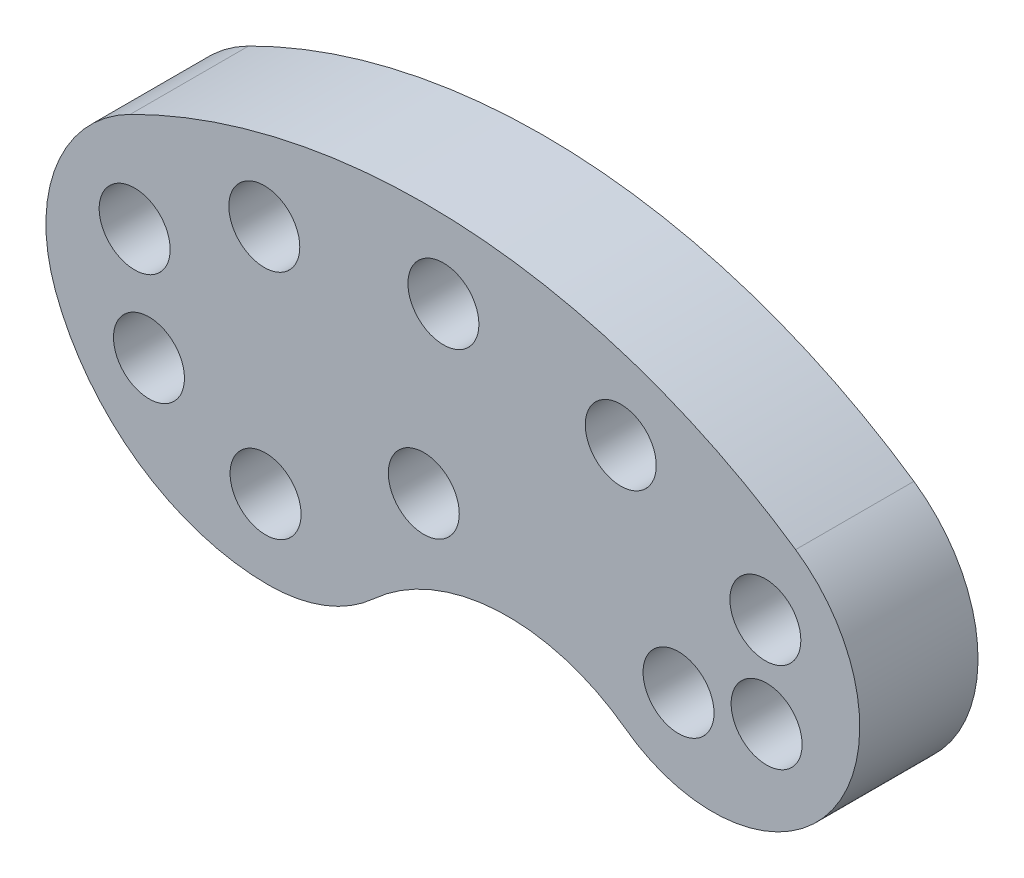
ISO-10303-21;
HEADER;
FILE_DESCRIPTION(('STEP AP214'),'2;1');
FILE_NAME('part.step','',(''),(''),'','','');
FILE_SCHEMA(('AUTOMOTIVE_DESIGN { 1 0 10303 214 1 1 1 1 }'));
ENDSEC;
DATA;
#1=APPLICATION_CONTEXT('core data for automotive mechanical design processes');
#2=APPLICATION_PROTOCOL_DEFINITION('international standard','automotive_design',2000,#1);
#3=PRODUCT_CONTEXT('',#1,'mechanical');
#4=PRODUCT('Part','Part','',(#3));
#5=PRODUCT_RELATED_PRODUCT_CATEGORY('part','',(#4));
#6=PRODUCT_DEFINITION_FORMATION('','',#4);
#7=PRODUCT_DEFINITION_CONTEXT('part definition',#1,'design');
#8=PRODUCT_DEFINITION('design','',#6,#7);
#9=PRODUCT_DEFINITION_SHAPE('','',#8);
#10=(LENGTH_UNIT() NAMED_UNIT(*) SI_UNIT(.MILLI.,.METRE.));
#11=(NAMED_UNIT(*) PLANE_ANGLE_UNIT() SI_UNIT($,.RADIAN.));
#12=(NAMED_UNIT(*) SI_UNIT($,.STERADIAN.) SOLID_ANGLE_UNIT());
#13=UNCERTAINTY_MEASURE_WITH_UNIT(LENGTH_MEASURE(1.E-05),#10,'distance_accuracy_value','');
#14=(GEOMETRIC_REPRESENTATION_CONTEXT(3) GLOBAL_UNCERTAINTY_ASSIGNED_CONTEXT((#13)) GLOBAL_UNIT_ASSIGNED_CONTEXT((#10,
#11,#12)) REPRESENTATION_CONTEXT('',''));
#15=CARTESIAN_POINT('',(0.,0.,0.));
#16=DIRECTION('',(0.,0.,1.));
#17=DIRECTION('',(1.,0.,0.));
#18=AXIS2_PLACEMENT_3D('',#15,#16,#17);
#19=CARTESIAN_POINT('',(5.85175887708347,2.1656115529364,10.));
#20=DIRECTION('',(0.,0.,-1.));
#21=DIRECTION('',(-1.,0.,0.));
#22=AXIS2_PLACEMENT_3D('',#19,#20,#21);
#23=CYLINDRICAL_SURFACE('',#22,19.2063081866916);
#24=CARTESIAN_POINT('',(5.85175887708347,2.1656115529364,0.));
#25=DIRECTION('',(0.,0.,1.));
#26=DIRECTION('',(1.,0.,0.));
#27=AXIS2_PLACEMENT_3D('',#24,#25,#26);
#28=CIRCLE('',#27,19.2063081866916);
#29=CARTESIAN_POINT('',(-12.1606430863832,-4.50039547291348,0.));
#30=VERTEX_POINT('',#29);
#31=CARTESIAN_POINT('',(5.85175887708346,-17.0406966337552,0.));
#32=VERTEX_POINT('',#31);
#33=EDGE_CURVE('E150',#30,#32,#28,.T.);
#34=ORIENTED_EDGE('',*,*,#33,.T.);
#35=DIRECTION('',(0.,0.,-1.));
#36=VECTOR('',#35,1.);
#37=CARTESIAN_POINT('',(5.85175887708346,-17.0406966337552,10.));
#38=LINE('',#37,#36);
#39=CARTESIAN_POINT('',(5.85175887708346,-17.0406966337552,10.));
#40=VERTEX_POINT('',#39);
#41=EDGE_CURVE('E13',#40,#32,#38,.T.);
#42=ORIENTED_EDGE('',*,*,#41,.F.);
#43=CARTESIAN_POINT('',(5.85175887708347,2.1656115529364,10.));
#44=DIRECTION('',(0.,0.,1.));
#45=DIRECTION('',(1.,0.,0.));
#46=AXIS2_PLACEMENT_3D('',#43,#44,#45);
#47=CIRCLE('',#46,19.2063081866916);
#48=CARTESIAN_POINT('',(-12.1606430863832,-4.50039547291348,10.));
#49=VERTEX_POINT('',#48);
#50=EDGE_CURVE('E161',#49,#40,#47,.T.);
#51=ORIENTED_EDGE('',*,*,#50,.F.);
#52=DIRECTION('',(0.,0.,-1.));
#53=VECTOR('',#52,1.);
#54=CARTESIAN_POINT('',(-12.1606430863832,-4.50039547291348,10.));
#55=LINE('',#54,#53);
#56=EDGE_CURVE('E146',#49,#30,#55,.T.);
#57=ORIENTED_EDGE('',*,*,#56,.T.);
#58=EDGE_LOOP('',(#34,#42,#51,#57));
#59=FACE_BOUND('',#58,.T.);
#60=ADVANCED_FACE('F66',(#59),#23,.T.);
#61=CARTESIAN_POINT('',(5.85175887708346,-3.8304950290572,10.));
#62=DIRECTION('',(0.,0.,-1.));
#63=DIRECTION('',(-1.,0.,0.));
#64=AXIS2_PLACEMENT_3D('',#61,#62,#63);
#65=CYLINDRICAL_SURFACE('',#64,13.210201604698);
#66=CARTESIAN_POINT('',(5.85175887708346,-3.8304950290572,0.));
#67=DIRECTION('',(0.,0.,1.));
#68=DIRECTION('',(1.,0.,0.));
#69=AXIS2_PLACEMENT_3D('',#66,#67,#68);
#70=CIRCLE('',#69,13.210201604698);
#71=CARTESIAN_POINT('',(14.7471140271899,-13.5968701595875,0.));
#72=VERTEX_POINT('',#71);
#73=EDGE_CURVE('E153',#32,#72,#70,.T.);
#74=ORIENTED_EDGE('',*,*,#73,.T.);
#75=DIRECTION('',(0.,0.,-1.));
#76=VECTOR('',#75,1.);
#77=CARTESIAN_POINT('',(14.7471140271899,-13.5968701595875,10.));
#78=LINE('',#77,#76);
#79=CARTESIAN_POINT('',(14.7471140271899,-13.5968701595875,10.));
#80=VERTEX_POINT('',#79);
#81=EDGE_CURVE('E74',#80,#72,#78,.T.);
#82=ORIENTED_EDGE('',*,*,#81,.F.);
#83=CARTESIAN_POINT('',(5.85175887708346,-3.8304950290572,10.));
#84=DIRECTION('',(0.,0.,1.));
#85=DIRECTION('',(1.,0.,0.));
#86=AXIS2_PLACEMENT_3D('',#83,#84,#85);
#87=CIRCLE('',#86,13.210201604698);
#88=EDGE_CURVE('E119',#40,#80,#87,.T.);
#89=ORIENTED_EDGE('',*,*,#88,.F.);
#90=ORIENTED_EDGE('',*,*,#41,.T.);
#91=EDGE_LOOP('',(#74,#82,#89,#90));
#92=FACE_BOUND('',#91,.T.);
#93=ADVANCED_FACE('F186',(#92),#65,.T.);
#94=CARTESIAN_POINT('',(26.0784990654728,-26.0378076111996,10.));
#95=DIRECTION('',(0.,0.,-1.));
#96=DIRECTION('',(-1.,0.,0.));
#97=AXIS2_PLACEMENT_3D('',#94,#95,#96);
#98=CYLINDRICAL_SURFACE('',#97,16.8278700839039);
#99=CARTESIAN_POINT('',(26.0784990654728,-26.0378076111996,0.));
#100=DIRECTION('',(0.,0.,-1.));
#101=DIRECTION('',(-1.,0.,0.));
#102=AXIS2_PLACEMENT_3D('',#99,#100,#101);
#103=CIRCLE('',#102,16.8278700839039);
#104=CARTESIAN_POINT('',(36.0320501876103,-12.4693135304351,0.));
#105=VERTEX_POINT('',#104);
#106=EDGE_CURVE('E156',#72,#105,#103,.T.);
#107=ORIENTED_EDGE('',*,*,#106,.T.);
#108=DIRECTION('',(0.,0.,-1.));
#109=VECTOR('',#108,1.);
#110=CARTESIAN_POINT('',(36.0320501876103,-12.4693135304351,10.));
#111=LINE('',#110,#109);
#112=CARTESIAN_POINT('',(36.0320501876103,-12.4693135304351,10.));
#113=VERTEX_POINT('',#112);
#114=EDGE_CURVE('E141',#113,#105,#111,.T.);
#115=ORIENTED_EDGE('',*,*,#114,.F.);
#116=CARTESIAN_POINT('',(26.0784990654728,-26.0378076111996,10.));
#117=DIRECTION('',(0.,0.,-1.));
#118=DIRECTION('',(-1.,0.,0.));
#119=AXIS2_PLACEMENT_3D('',#116,#117,#118);
#120=CIRCLE('',#119,16.8278700839039);
#121=EDGE_CURVE('E132',#80,#113,#120,.T.);
#122=ORIENTED_EDGE('',*,*,#121,.F.);
#123=ORIENTED_EDGE('',*,*,#81,.T.);
#124=EDGE_LOOP('',(#107,#115,#122,#123));
#125=FACE_BOUND('',#124,.T.);
#126=ADVANCED_FACE('F167',(#125),#98,.F.);
#127=CARTESIAN_POINT('',(43.3913949682875,-2.43719284610579,10.));
#128=DIRECTION('',(0.,0.,-1.));
#129=DIRECTION('',(-1.,0.,0.));
#130=AXIS2_PLACEMENT_3D('',#127,#128,#129);
#131=CYLINDRICAL_SURFACE('',#130,12.4420014879371);
#132=CARTESIAN_POINT('',(43.3913949682875,-2.43719284610579,0.));
#133=DIRECTION('',(0.,0.,1.));
#134=DIRECTION('',(-1.,0.,0.));
#135=AXIS2_PLACEMENT_3D('',#132,#133,#134);
#136=CIRCLE('',#135,12.4420014879371);
#137=CARTESIAN_POINT('',(50.4131388075344,7.83405413183342,0.));
#138=VERTEX_POINT('',#137);
#139=EDGE_CURVE('E140',#105,#138,#136,.T.);
#140=ORIENTED_EDGE('',*,*,#139,.T.);
#141=DIRECTION('',(0.,0.,-1.));
#142=VECTOR('',#141,1.);
#143=CARTESIAN_POINT('',(50.4131388075344,7.83405413183342,10.));
#144=LINE('',#143,#142);
#145=CARTESIAN_POINT('',(50.4131388075344,7.83405413183342,10.));
#146=VERTEX_POINT('',#145);
#147=EDGE_CURVE('E137',#146,#138,#144,.T.);
#148=ORIENTED_EDGE('',*,*,#147,.F.);
#149=CARTESIAN_POINT('',(43.3913949682875,-2.43719284610579,10.));
#150=DIRECTION('',(0.,0.,1.));
#151=DIRECTION('',(-1.,0.,0.));
#152=AXIS2_PLACEMENT_3D('',#149,#150,#151);
#153=CIRCLE('',#152,12.4420014879371);
#154=EDGE_CURVE('E126',#113,#146,#153,.T.);
#155=ORIENTED_EDGE('',*,*,#154,.F.);
#156=ORIENTED_EDGE('',*,*,#114,.T.);
#157=EDGE_LOOP('',(#140,#148,#155,#156));
#158=FACE_BOUND('',#157,.T.);
#159=ADVANCED_FACE('F138',(#158),#131,.T.);
#160=CARTESIAN_POINT('',(19.1158006826502,-37.9469793254102,10.));
#161=DIRECTION('',(0.,0.,-1.));
#162=DIRECTION('',(-1.,0.,0.));
#163=AXIS2_PLACEMENT_3D('',#160,#161,#162);
#164=CYLINDRICAL_SURFACE('',#163,55.456527101114);
#165=CARTESIAN_POINT('',(19.1158006826502,-37.9469793254102,0.));
#166=DIRECTION('',(0.,0.,1.));
#167=DIRECTION('',(-1.,0.,0.));
#168=AXIS2_PLACEMENT_3D('',#165,#166,#167);
#169=CIRCLE('',#168,55.456527101114);
#170=CARTESIAN_POINT('',(-5.83359311487662,11.5803277612114,0.));
#171=VERTEX_POINT('',#170);
#172=EDGE_CURVE('E105',#138,#171,#169,.T.);
#173=ORIENTED_EDGE('',*,*,#172,.T.);
#174=DIRECTION('',(0.,0.,-1.));
#175=VECTOR('',#174,1.);
#176=CARTESIAN_POINT('',(-5.83359311487662,11.5803277612114,10.));
#177=LINE('',#176,#175);
#178=CARTESIAN_POINT('',(-5.83359311487662,11.5803277612114,10.));
#179=VERTEX_POINT('',#178);
#180=EDGE_CURVE('E142',#179,#171,#177,.T.);
#181=ORIENTED_EDGE('',*,*,#180,.F.);
#182=CARTESIAN_POINT('',(19.1158006826502,-37.9469793254102,10.));
#183=DIRECTION('',(0.,0.,1.));
#184=DIRECTION('',(-1.,0.,0.));
#185=AXIS2_PLACEMENT_3D('',#182,#183,#184);
#186=CIRCLE('',#185,55.456527101114);
#187=EDGE_CURVE('E130',#146,#179,#186,.T.);
#188=ORIENTED_EDGE('',*,*,#187,.F.);
#189=ORIENTED_EDGE('',*,*,#147,.T.);
#190=EDGE_LOOP('',(#173,#181,#188,#189));
#191=FACE_BOUND('',#190,.T.);
#192=ADVANCED_FACE('F144',(#191),#164,.T.);
#193=CARTESIAN_POINT('',(0.,0.,10.));
#194=DIRECTION('',(0.,0.,-1.));
#195=DIRECTION('',(-1.,0.,0.));
#196=AXIS2_PLACEMENT_3D('',#193,#194,#195);
#197=CYLINDRICAL_SURFACE('',#196,12.9666803649593);
#198=CARTESIAN_POINT('',(0.,0.,0.));
#199=DIRECTION('',(0.,0.,1.));
#200=DIRECTION('',(-1.,0.,0.));
#201=AXIS2_PLACEMENT_3D('',#198,#199,#200);
#202=CIRCLE('',#201,12.9666803649593);
#203=EDGE_CURVE('E111',#171,#30,#202,.T.);
#204=ORIENTED_EDGE('',*,*,#203,.T.);
#205=ORIENTED_EDGE('',*,*,#56,.F.);
#206=CARTESIAN_POINT('',(0.,0.,10.));
#207=DIRECTION('',(0.,0.,1.));
#208=DIRECTION('',(-1.,0.,0.));
#209=AXIS2_PLACEMENT_3D('',#206,#207,#208);
#210=CIRCLE('',#209,12.9666803649593);
#211=EDGE_CURVE('E82',#179,#49,#210,.T.);
#212=ORIENTED_EDGE('',*,*,#211,.F.);
#213=ORIENTED_EDGE('',*,*,#180,.T.);
#214=EDGE_LOOP('',(#204,#205,#212,#213));
#215=FACE_BOUND('',#214,.T.);
#216=ADVANCED_FACE('F174',(#215),#197,.T.);
#217=CARTESIAN_POINT('',(5.85175887708347,-0.832441738060397,10.));
#218=DIRECTION('',(0.,0.,1.));
#219=DIRECTION('',(1.,0.,0.));
#220=AXIS2_PLACEMENT_3D('',#217,#218,#219);
#221=PLANE('',#220);
#222=CARTESIAN_POINT('',(20.6370405286991,10.9397441905562,10.));
#223=DIRECTION('',(0.,0.,1.));
#224=DIRECTION('',(1.,0.,0.));
#225=AXIS2_PLACEMENT_3D('',#222,#223,#224);
#226=CIRCLE('',#225,3.);
#227=CARTESIAN_POINT('',(23.6370405286991,10.9397441905562,10.));
#228=VERTEX_POINT('',#227);
#229=EDGE_CURVE('E332',#228,#228,#226,.T.);
#230=ORIENTED_EDGE('',*,*,#229,.F.);
#231=EDGE_LOOP('',(#230));
#232=FACE_BOUND('',#231,.T.);
#233=CARTESIAN_POINT('',(35.6303160445887,8.09101247653578,10.));
#234=DIRECTION('',(0.,0.,1.));
#235=DIRECTION('',(1.,0.,0.));
#236=AXIS2_PLACEMENT_3D('',#233,#234,#235);
#237=CIRCLE('',#236,3.);
#238=CARTESIAN_POINT('',(38.6303160445887,8.09101247653578,10.));
#239=VERTEX_POINT('',#238);
#240=EDGE_CURVE('E334',#239,#239,#237,.T.);
#241=ORIENTED_EDGE('',*,*,#240,.F.);
#242=EDGE_LOOP('',(#241));
#243=FACE_BOUND('',#242,.T.);
#244=CARTESIAN_POINT('',(47.8537304266924,1.41621314846178,10.));
#245=DIRECTION('',(0.,0.,1.));
#246=DIRECTION('',(1.,0.,0.));
#247=AXIS2_PLACEMENT_3D('',#244,#245,#246);
#248=CIRCLE('',#247,3.);
#249=CARTESIAN_POINT('',(50.8537304266924,1.41621314846178,10.));
#250=VERTEX_POINT('',#249);
#251=EDGE_CURVE('E415',#250,#250,#248,.T.);
#252=ORIENTED_EDGE('',*,*,#251,.F.);
#253=EDGE_LOOP('',(#252));
#254=FACE_BOUND('',#253,.T.);
#255=CARTESIAN_POINT('',(47.9603070289603,-6.1636144653198,10.));
#256=DIRECTION('',(0.,0.,1.));
#257=DIRECTION('',(1.,0.,0.));
#258=AXIS2_PLACEMENT_3D('',#255,#256,#257);
#259=CIRCLE('',#258,3.);
#260=CARTESIAN_POINT('',(50.9603070289603,-6.1636144653198,10.));
#261=VERTEX_POINT('',#260);
#262=EDGE_CURVE('E408',#261,#261,#259,.T.);
#263=ORIENTED_EDGE('',*,*,#262,.F.);
#264=EDGE_LOOP('',(#263));
#265=FACE_BOUND('',#264,.T.);
#266=CARTESIAN_POINT('',(40.5138250450017,-7.58313948777518,10.));
#267=DIRECTION('',(0.,0.,1.));
#268=DIRECTION('',(1.,0.,0.));
#269=AXIS2_PLACEMENT_3D('',#266,#267,#268);
#270=CIRCLE('',#269,3.);
#271=CARTESIAN_POINT('',(43.5138250450017,-7.58313948777518,10.));
#272=VERTEX_POINT('',#271);
#273=EDGE_CURVE('E360',#272,#272,#270,.T.);
#274=ORIENTED_EDGE('',*,*,#273,.F.);
#275=EDGE_LOOP('',(#274));
#276=FACE_BOUND('',#275,.T.);
#277=CARTESIAN_POINT('',(18.9783039516125,-3.76828572089092,10.));
#278=DIRECTION('',(0.,0.,1.));
#279=DIRECTION('',(1.,0.,0.));
#280=AXIS2_PLACEMENT_3D('',#277,#278,#279);
#281=CIRCLE('',#280,3.);
#282=CARTESIAN_POINT('',(21.9783039516125,-3.76828572089092,10.));
#283=VERTEX_POINT('',#282);
#284=EDGE_CURVE('E354',#283,#283,#281,.T.);
#285=ORIENTED_EDGE('',*,*,#284,.F.);
#286=EDGE_LOOP('',(#285));
#287=FACE_BOUND('',#286,.T.);
#288=CARTESIAN_POINT('',(5.60261441126971,-10.4921042807844,10.));
#289=DIRECTION('',(0.,0.,1.));
#290=DIRECTION('',(1.,0.,0.));
#291=AXIS2_PLACEMENT_3D('',#288,#289,#290);
#292=CIRCLE('',#291,3.);
#293=CARTESIAN_POINT('',(8.60261441126971,-10.4921042807844,10.));
#294=VERTEX_POINT('',#293);
#295=EDGE_CURVE('E348',#294,#294,#292,.T.);
#296=ORIENTED_EDGE('',*,*,#295,.F.);
#297=EDGE_LOOP('',(#296));
#298=FACE_BOUND('',#297,.T.);
#299=CARTESIAN_POINT('',(-4.25384786327034,-5.4604329985586,10.));
#300=DIRECTION('',(0.,0.,1.));
#301=DIRECTION('',(1.,0.,0.));
#302=AXIS2_PLACEMENT_3D('',#299,#300,#301);
#303=CIRCLE('',#302,3.);
#304=CARTESIAN_POINT('',(-1.25384786327034,-5.4604329985586,10.));
#305=VERTEX_POINT('',#304);
#306=EDGE_CURVE('E340',#305,#305,#303,.T.);
#307=ORIENTED_EDGE('',*,*,#306,.F.);
#308=EDGE_LOOP('',(#307));
#309=FACE_BOUND('',#308,.T.);
#310=CARTESIAN_POINT('',(-5.46357336672202,3.37234292780181,10.));
#311=DIRECTION('',(0.,0.,1.));
#312=DIRECTION('',(1.,0.,0.));
#313=AXIS2_PLACEMENT_3D('',#310,#311,#312);
#314=CIRCLE('',#313,3.);
#315=CARTESIAN_POINT('',(-2.46357336672202,3.37234292780181,10.));
#316=VERTEX_POINT('',#315);
#317=EDGE_CURVE('E347',#316,#316,#314,.T.);
#318=ORIENTED_EDGE('',*,*,#317,.F.);
#319=EDGE_LOOP('',(#318));
#320=FACE_BOUND('',#319,.T.);
#321=CARTESIAN_POINT('',(5.4956529878325,9.02873230908341,10.));
#322=DIRECTION('',(0.,0.,1.));
#323=DIRECTION('',(1.,0.,0.));
#324=AXIS2_PLACEMENT_3D('',#321,#322,#323);
#325=CIRCLE('',#324,3.);
#326=CARTESIAN_POINT('',(8.4956529878325,9.02873230908341,10.));
#327=VERTEX_POINT('',#326);
#328=EDGE_CURVE('E371',#327,#327,#325,.T.);
#329=ORIENTED_EDGE('',*,*,#328,.F.);
#330=EDGE_LOOP('',(#329));
#331=FACE_BOUND('',#330,.T.);
#332=ORIENTED_EDGE('',*,*,#50,.T.);
#333=ORIENTED_EDGE('',*,*,#88,.T.);
#334=ORIENTED_EDGE('',*,*,#121,.T.);
#335=ORIENTED_EDGE('',*,*,#154,.T.);
#336=ORIENTED_EDGE('',*,*,#187,.T.);
#337=ORIENTED_EDGE('',*,*,#211,.T.);
#338=EDGE_LOOP('',(#332,#333,#334,#335,#336,#337));
#339=FACE_BOUND('',#338,.T.);
#340=ADVANCED_FACE('F128',(#232,#243,#254,#265,#276,#287,#298,#309,#320,#331,#339),#221,.T.);
#341=CARTESIAN_POINT('',(5.85175887708347,-0.832441738060397,0.));
#342=DIRECTION('',(0.,0.,1.));
#343=DIRECTION('',(1.,0.,0.));
#344=AXIS2_PLACEMENT_3D('',#341,#342,#343);
#345=PLANE('',#344);
#346=CARTESIAN_POINT('',(20.6370405286991,10.9397441905562,0.));
#347=DIRECTION('',(0.,0.,1.));
#348=DIRECTION('',(1.,0.,0.));
#349=AXIS2_PLACEMENT_3D('',#346,#347,#348);
#350=CIRCLE('',#349,3.);
#351=CARTESIAN_POINT('',(23.6370405286991,10.9397441905562,0.));
#352=VERTEX_POINT('',#351);
#353=EDGE_CURVE('E329',#352,#352,#350,.F.);
#354=ORIENTED_EDGE('',*,*,#353,.F.);
#355=EDGE_LOOP('',(#354));
#356=FACE_BOUND('',#355,.T.);
#357=CARTESIAN_POINT('',(35.6303160445887,8.09101247653578,0.));
#358=DIRECTION('',(0.,0.,1.));
#359=DIRECTION('',(1.,0.,0.));
#360=AXIS2_PLACEMENT_3D('',#357,#358,#359);
#361=CIRCLE('',#360,3.);
#362=CARTESIAN_POINT('',(38.6303160445887,8.09101247653578,0.));
#363=VERTEX_POINT('',#362);
#364=EDGE_CURVE('E337',#363,#363,#361,.F.);
#365=ORIENTED_EDGE('',*,*,#364,.F.);
#366=EDGE_LOOP('',(#365));
#367=FACE_BOUND('',#366,.T.);
#368=CARTESIAN_POINT('',(47.8537304266924,1.41621314846178,0.));
#369=DIRECTION('',(0.,0.,1.));
#370=DIRECTION('',(1.,0.,0.));
#371=AXIS2_PLACEMENT_3D('',#368,#369,#370);
#372=CIRCLE('',#371,3.);
#373=CARTESIAN_POINT('',(50.8537304266924,1.41621314846178,0.));
#374=VERTEX_POINT('',#373);
#375=EDGE_CURVE('E412',#374,#374,#372,.F.);
#376=ORIENTED_EDGE('',*,*,#375,.F.);
#377=EDGE_LOOP('',(#376));
#378=FACE_BOUND('',#377,.T.);
#379=CARTESIAN_POINT('',(47.9603070289603,-6.1636144653198,0.));
#380=DIRECTION('',(0.,0.,1.));
#381=DIRECTION('',(1.,0.,0.));
#382=AXIS2_PLACEMENT_3D('',#379,#380,#381);
#383=CIRCLE('',#382,3.);
#384=CARTESIAN_POINT('',(50.9603070289603,-6.1636144653198,0.));
#385=VERTEX_POINT('',#384);
#386=EDGE_CURVE('E363',#385,#385,#383,.F.);
#387=ORIENTED_EDGE('',*,*,#386,.F.);
#388=EDGE_LOOP('',(#387));
#389=FACE_BOUND('',#388,.T.);
#390=CARTESIAN_POINT('',(40.5138250450017,-7.58313948777518,0.));
#391=DIRECTION('',(0.,0.,1.));
#392=DIRECTION('',(1.,0.,0.));
#393=AXIS2_PLACEMENT_3D('',#390,#391,#392);
#394=CIRCLE('',#393,3.);
#395=CARTESIAN_POINT('',(43.5138250450017,-7.58313948777518,0.));
#396=VERTEX_POINT('',#395);
#397=EDGE_CURVE('E357',#396,#396,#394,.F.);
#398=ORIENTED_EDGE('',*,*,#397,.F.);
#399=EDGE_LOOP('',(#398));
#400=FACE_BOUND('',#399,.T.);
#401=CARTESIAN_POINT('',(18.9783039516125,-3.76828572089092,0.));
#402=DIRECTION('',(0.,0.,1.));
#403=DIRECTION('',(1.,0.,0.));
#404=AXIS2_PLACEMENT_3D('',#401,#402,#403);
#405=CIRCLE('',#404,3.);
#406=CARTESIAN_POINT('',(21.9783039516125,-3.76828572089092,0.));
#407=VERTEX_POINT('',#406);
#408=EDGE_CURVE('E351',#407,#407,#405,.F.);
#409=ORIENTED_EDGE('',*,*,#408,.F.);
#410=EDGE_LOOP('',(#409));
#411=FACE_BOUND('',#410,.T.);
#412=CARTESIAN_POINT('',(5.60261441126971,-10.4921042807844,0.));
#413=DIRECTION('',(0.,0.,1.));
#414=DIRECTION('',(1.,0.,0.));
#415=AXIS2_PLACEMENT_3D('',#412,#413,#414);
#416=CIRCLE('',#415,3.);
#417=CARTESIAN_POINT('',(8.60261441126971,-10.4921042807844,0.));
#418=VERTEX_POINT('',#417);
#419=EDGE_CURVE('E344',#418,#418,#416,.F.);
#420=ORIENTED_EDGE('',*,*,#419,.F.);
#421=EDGE_LOOP('',(#420));
#422=FACE_BOUND('',#421,.T.);
#423=CARTESIAN_POINT('',(-4.25384786327034,-5.4604329985586,0.));
#424=DIRECTION('',(0.,0.,1.));
#425=DIRECTION('',(1.,0.,0.));
#426=AXIS2_PLACEMENT_3D('',#423,#424,#425);
#427=CIRCLE('',#426,3.);
#428=CARTESIAN_POINT('',(-1.25384786327034,-5.4604329985586,0.));
#429=VERTEX_POINT('',#428);
#430=EDGE_CURVE('E343',#429,#429,#427,.F.);
#431=ORIENTED_EDGE('',*,*,#430,.F.);
#432=EDGE_LOOP('',(#431));
#433=FACE_BOUND('',#432,.T.);
#434=CARTESIAN_POINT('',(-5.46357336672202,3.37234292780181,0.));
#435=DIRECTION('',(0.,0.,1.));
#436=DIRECTION('',(1.,0.,0.));
#437=AXIS2_PLACEMENT_3D('',#434,#435,#436);
#438=CIRCLE('',#437,3.);
#439=CARTESIAN_POINT('',(-2.46357336672202,3.37234292780181,0.));
#440=VERTEX_POINT('',#439);
#441=EDGE_CURVE('E368',#440,#440,#438,.F.);
#442=ORIENTED_EDGE('',*,*,#441,.F.);
#443=EDGE_LOOP('',(#442));
#444=FACE_BOUND('',#443,.T.);
#445=CARTESIAN_POINT('',(5.4956529878325,9.02873230908341,0.));
#446=DIRECTION('',(0.,0.,1.));
#447=DIRECTION('',(1.,0.,0.));
#448=AXIS2_PLACEMENT_3D('',#445,#446,#447);
#449=CIRCLE('',#448,3.);
#450=CARTESIAN_POINT('',(8.4956529878325,9.02873230908341,0.));
#451=VERTEX_POINT('',#450);
#452=EDGE_CURVE('E154',#451,#451,#449,.F.);
#453=ORIENTED_EDGE('',*,*,#452,.F.);
#454=EDGE_LOOP('',(#453));
#455=FACE_BOUND('',#454,.T.);
#456=ORIENTED_EDGE('',*,*,#33,.F.);
#457=ORIENTED_EDGE('',*,*,#203,.F.);
#458=ORIENTED_EDGE('',*,*,#172,.F.);
#459=ORIENTED_EDGE('',*,*,#139,.F.);
#460=ORIENTED_EDGE('',*,*,#106,.F.);
#461=ORIENTED_EDGE('',*,*,#73,.F.);
#462=EDGE_LOOP('',(#456,#457,#458,#459,#460,#461));
#463=FACE_BOUND('',#462,.T.);
#464=ADVANCED_FACE('F170',(#356,#367,#378,#389,#400,#411,#422,#433,#444,#455,#463),#345,.F.);
#465=CARTESIAN_POINT('',(5.4956529878325,9.02873230908341,-8.48528137423857));
#466=DIRECTION('',(0.,0.,1.));
#467=DIRECTION('',(1.,0.,0.));
#468=AXIS2_PLACEMENT_3D('',#465,#466,#467);
#469=CYLINDRICAL_SURFACE('',#468,3.);
#470=ORIENTED_EDGE('',*,*,#452,.T.);
#471=EDGE_LOOP('',(#470));
#472=FACE_BOUND('',#471,.T.);
#473=ORIENTED_EDGE('',*,*,#328,.T.);
#474=EDGE_LOOP('',(#473));
#475=FACE_BOUND('',#474,.T.);
#476=ADVANCED_FACE('F214',(#472,#475),#469,.F.);
#477=CARTESIAN_POINT('',(-5.46357336672202,3.37234292780181,-8.48528137423857));
#478=DIRECTION('',(0.,0.,1.));
#479=DIRECTION('',(1.,0.,0.));
#480=AXIS2_PLACEMENT_3D('',#477,#478,#479);
#481=CYLINDRICAL_SURFACE('',#480,3.);
#482=ORIENTED_EDGE('',*,*,#441,.T.);
#483=EDGE_LOOP('',(#482));
#484=FACE_BOUND('',#483,.T.);
#485=ORIENTED_EDGE('',*,*,#317,.T.);
#486=EDGE_LOOP('',(#485));
#487=FACE_BOUND('',#486,.T.);
#488=ADVANCED_FACE('F219',(#484,#487),#481,.F.);
#489=CARTESIAN_POINT('',(-4.25384786327034,-5.4604329985586,-8.48528137423857));
#490=DIRECTION('',(0.,0.,1.));
#491=DIRECTION('',(1.,0.,0.));
#492=AXIS2_PLACEMENT_3D('',#489,#490,#491);
#493=CYLINDRICAL_SURFACE('',#492,3.);
#494=ORIENTED_EDGE('',*,*,#430,.T.);
#495=EDGE_LOOP('',(#494));
#496=FACE_BOUND('',#495,.T.);
#497=ORIENTED_EDGE('',*,*,#306,.T.);
#498=EDGE_LOOP('',(#497));
#499=FACE_BOUND('',#498,.T.);
#500=ADVANCED_FACE('F242',(#496,#499),#493,.F.);
#501=CARTESIAN_POINT('',(5.60261441126971,-10.4921042807844,-8.48528137423857));
#502=DIRECTION('',(0.,0.,1.));
#503=DIRECTION('',(1.,0.,0.));
#504=AXIS2_PLACEMENT_3D('',#501,#502,#503);
#505=CYLINDRICAL_SURFACE('',#504,3.);
#506=ORIENTED_EDGE('',*,*,#419,.T.);
#507=EDGE_LOOP('',(#506));
#508=FACE_BOUND('',#507,.T.);
#509=ORIENTED_EDGE('',*,*,#295,.T.);
#510=EDGE_LOOP('',(#509));
#511=FACE_BOUND('',#510,.T.);
#512=ADVANCED_FACE('F252',(#508,#511),#505,.F.);
#513=CARTESIAN_POINT('',(18.9783039516125,-3.76828572089092,-8.48528137423857));
#514=DIRECTION('',(0.,0.,1.));
#515=DIRECTION('',(1.,0.,0.));
#516=AXIS2_PLACEMENT_3D('',#513,#514,#515);
#517=CYLINDRICAL_SURFACE('',#516,3.);
#518=ORIENTED_EDGE('',*,*,#408,.T.);
#519=EDGE_LOOP('',(#518));
#520=FACE_BOUND('',#519,.T.);
#521=ORIENTED_EDGE('',*,*,#284,.T.);
#522=EDGE_LOOP('',(#521));
#523=FACE_BOUND('',#522,.T.);
#524=ADVANCED_FACE('F262',(#520,#523),#517,.F.);
#525=CARTESIAN_POINT('',(40.5138250450017,-7.58313948777518,-8.48528137423857));
#526=DIRECTION('',(0.,0.,1.));
#527=DIRECTION('',(1.,0.,0.));
#528=AXIS2_PLACEMENT_3D('',#525,#526,#527);
#529=CYLINDRICAL_SURFACE('',#528,3.);
#530=ORIENTED_EDGE('',*,*,#397,.T.);
#531=EDGE_LOOP('',(#530));
#532=FACE_BOUND('',#531,.T.);
#533=ORIENTED_EDGE('',*,*,#273,.T.);
#534=EDGE_LOOP('',(#533));
#535=FACE_BOUND('',#534,.T.);
#536=ADVANCED_FACE('F272',(#532,#535),#529,.F.);
#537=CARTESIAN_POINT('',(47.9603070289603,-6.1636144653198,-8.48528137423857));
#538=DIRECTION('',(0.,0.,1.));
#539=DIRECTION('',(1.,0.,0.));
#540=AXIS2_PLACEMENT_3D('',#537,#538,#539);
#541=CYLINDRICAL_SURFACE('',#540,3.);
#542=ORIENTED_EDGE('',*,*,#386,.T.);
#543=EDGE_LOOP('',(#542));
#544=FACE_BOUND('',#543,.T.);
#545=ORIENTED_EDGE('',*,*,#262,.T.);
#546=EDGE_LOOP('',(#545));
#547=FACE_BOUND('',#546,.T.);
#548=ADVANCED_FACE('F282',(#544,#547),#541,.F.);
#549=CARTESIAN_POINT('',(47.8537304266924,1.41621314846178,-8.48528137423856));
#550=DIRECTION('',(0.,0.,1.));
#551=DIRECTION('',(1.,0.,0.));
#552=AXIS2_PLACEMENT_3D('',#549,#550,#551);
#553=CYLINDRICAL_SURFACE('',#552,3.);
#554=ORIENTED_EDGE('',*,*,#375,.T.);
#555=EDGE_LOOP('',(#554));
#556=FACE_BOUND('',#555,.T.);
#557=ORIENTED_EDGE('',*,*,#251,.T.);
#558=EDGE_LOOP('',(#557));
#559=FACE_BOUND('',#558,.T.);
#560=ADVANCED_FACE('F292',(#556,#559),#553,.F.);
#561=CARTESIAN_POINT('',(35.6303160445887,8.09101247653578,-8.48528137423857));
#562=DIRECTION('',(0.,0.,1.));
#563=DIRECTION('',(1.,0.,0.));
#564=AXIS2_PLACEMENT_3D('',#561,#562,#563);
#565=CYLINDRICAL_SURFACE('',#564,3.);
#566=ORIENTED_EDGE('',*,*,#364,.T.);
#567=EDGE_LOOP('',(#566));
#568=FACE_BOUND('',#567,.T.);
#569=ORIENTED_EDGE('',*,*,#240,.T.);
#570=EDGE_LOOP('',(#569));
#571=FACE_BOUND('',#570,.T.);
#572=ADVANCED_FACE('F302',(#568,#571),#565,.F.);
#573=CARTESIAN_POINT('',(20.6370405286991,10.9397441905562,-8.48528137423857));
#574=DIRECTION('',(0.,0.,1.));
#575=DIRECTION('',(1.,0.,0.));
#576=AXIS2_PLACEMENT_3D('',#573,#574,#575);
#577=CYLINDRICAL_SURFACE('',#576,3.);
#578=ORIENTED_EDGE('',*,*,#353,.T.);
#579=EDGE_LOOP('',(#578));
#580=FACE_BOUND('',#579,.T.);
#581=ORIENTED_EDGE('',*,*,#229,.T.);
#582=EDGE_LOOP('',(#581));
#583=FACE_BOUND('',#582,.T.);
#584=ADVANCED_FACE('F312',(#580,#583),#577,.F.);
#585=CLOSED_SHELL('',(#60,#93,#126,#159,#192,#216,#340,#464,#476,#488,#500,#512,#524,#536,#548,
#560,#572,#584));
#586=MANIFOLD_SOLID_BREP('B2',#585);
#587=ADVANCED_BREP_SHAPE_REPRESENTATION('',(#18,#586),#14);
#588=SHAPE_DEFINITION_REPRESENTATION(#9,#587);
ENDSEC;
END-ISO-10303-21;
